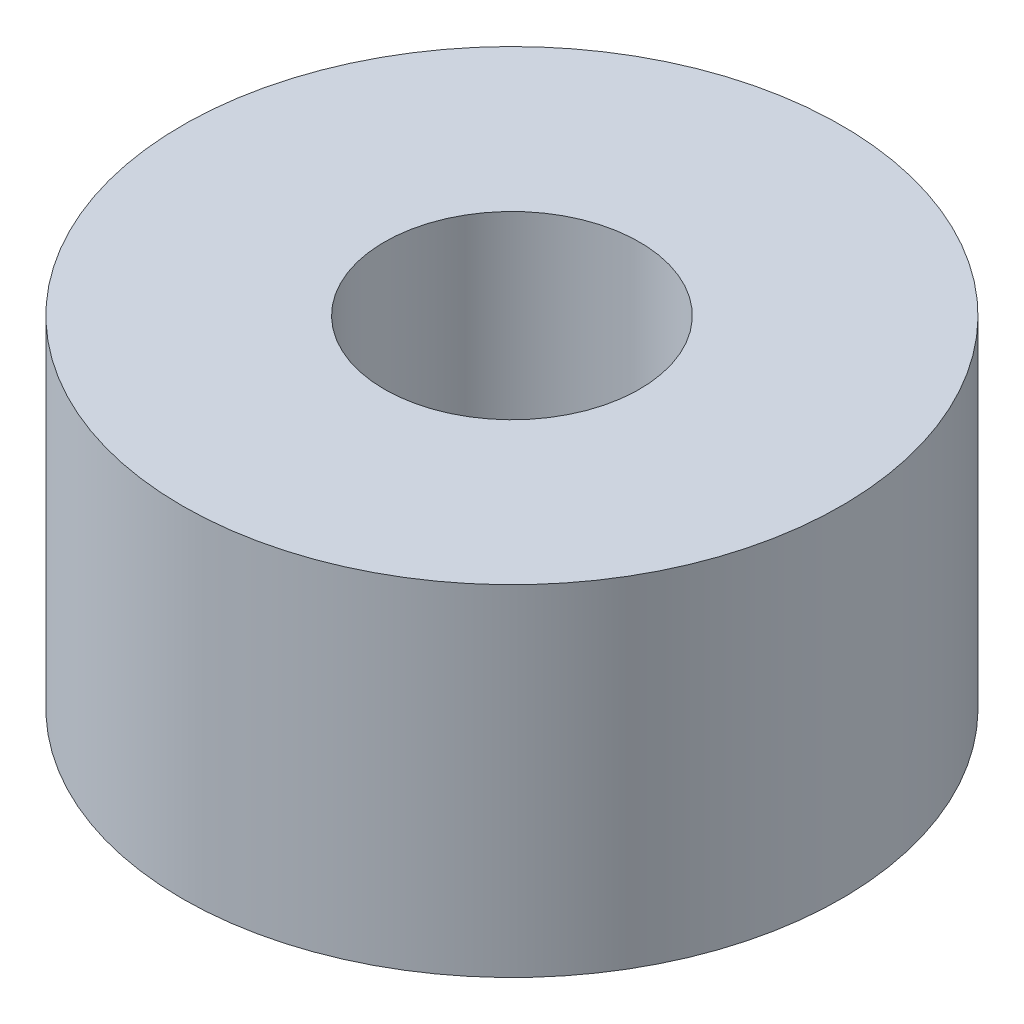
ISO-10303-21;
HEADER;
FILE_DESCRIPTION(('STEP AP214'),'2;1');
FILE_NAME('part.step','',(''),(''),'','','');
FILE_SCHEMA(('AUTOMOTIVE_DESIGN { 1 0 10303 214 1 1 1 1 }'));
ENDSEC;
DATA;
#1=APPLICATION_CONTEXT('core data for automotive mechanical design processes');
#2=APPLICATION_PROTOCOL_DEFINITION('international standard','automotive_design',2000,#1);
#3=PRODUCT_CONTEXT('',#1,'mechanical');
#4=PRODUCT('Part','Part','',(#3));
#5=PRODUCT_RELATED_PRODUCT_CATEGORY('part','',(#4));
#6=PRODUCT_DEFINITION_FORMATION('','',#4);
#7=PRODUCT_DEFINITION_CONTEXT('part definition',#1,'design');
#8=PRODUCT_DEFINITION('design','',#6,#7);
#9=PRODUCT_DEFINITION_SHAPE('','',#8);
#10=(LENGTH_UNIT() NAMED_UNIT(*) SI_UNIT(.MILLI.,.METRE.));
#11=(NAMED_UNIT(*) PLANE_ANGLE_UNIT() SI_UNIT($,.RADIAN.));
#12=(NAMED_UNIT(*) SI_UNIT($,.STERADIAN.) SOLID_ANGLE_UNIT());
#13=UNCERTAINTY_MEASURE_WITH_UNIT(LENGTH_MEASURE(1.E-05),#10,'distance_accuracy_value','');
#14=(GEOMETRIC_REPRESENTATION_CONTEXT(3) GLOBAL_UNCERTAINTY_ASSIGNED_CONTEXT((#13)) GLOBAL_UNIT_ASSIGNED_CONTEXT((#10,
#11,#12)) REPRESENTATION_CONTEXT('',''));
#15=CARTESIAN_POINT('',(0.,0.,0.));
#16=DIRECTION('',(0.,0.,1.));
#17=DIRECTION('',(1.,0.,0.));
#18=AXIS2_PLACEMENT_3D('',#15,#16,#17);
#19=CARTESIAN_POINT('',(0.,4.064,0.));
#20=DIRECTION('',(0.,1.,0.));
#21=DIRECTION('',(0.,0.,1.));
#22=AXIS2_PLACEMENT_3D('',#19,#20,#21);
#23=PLANE('',#22);
#24=CARTESIAN_POINT('',(0.,4.064,0.));
#25=DIRECTION('',(0.,1.,0.));
#26=DIRECTION('',(0.,0.,1.));
#27=AXIS2_PLACEMENT_3D('',#24,#25,#26);
#28=CIRCLE('',#27,3.937);
#29=CARTESIAN_POINT('',(0.,4.064,3.937));
#30=VERTEX_POINT('',#29);
#31=EDGE_CURVE('E10',#30,#30,#28,.T.);
#32=ORIENTED_EDGE('',*,*,#31,.T.);
#33=EDGE_LOOP('',(#32));
#34=FACE_BOUND('',#33,.T.);
#35=CARTESIAN_POINT('',(0.,4.064,0.));
#36=DIRECTION('',(0.,1.,0.));
#37=DIRECTION('',(0.,0.,1.));
#38=AXIS2_PLACEMENT_3D('',#35,#36,#37);
#39=CIRCLE('',#38,1.524);
#40=CARTESIAN_POINT('',(0.,4.064,1.524));
#41=VERTEX_POINT('',#40);
#42=EDGE_CURVE('E50',#41,#41,#39,.T.);
#43=ORIENTED_EDGE('',*,*,#42,.F.);
#44=EDGE_LOOP('',(#43));
#45=FACE_BOUND('',#44,.T.);
#46=ADVANCED_FACE('F37',(#34,#45),#23,.T.);
#47=CARTESIAN_POINT('',(0.,0.,0.));
#48=DIRECTION('',(0.,1.,0.));
#49=DIRECTION('',(0.,0.,1.));
#50=AXIS2_PLACEMENT_3D('',#47,#48,#49);
#51=PLANE('',#50);
#52=CARTESIAN_POINT('',(0.,0.,0.));
#53=DIRECTION('',(0.,1.,0.));
#54=DIRECTION('',(0.,0.,1.));
#55=AXIS2_PLACEMENT_3D('',#52,#53,#54);
#56=CIRCLE('',#55,3.937);
#57=CARTESIAN_POINT('',(0.,0.,3.937));
#58=VERTEX_POINT('',#57);
#59=EDGE_CURVE('E41',#58,#58,#56,.T.);
#60=ORIENTED_EDGE('',*,*,#59,.F.);
#61=EDGE_LOOP('',(#60));
#62=FACE_BOUND('',#61,.T.);
#63=CARTESIAN_POINT('',(0.,0.,0.));
#64=DIRECTION('',(0.,1.,0.));
#65=DIRECTION('',(0.,0.,1.));
#66=AXIS2_PLACEMENT_3D('',#63,#64,#65);
#67=CIRCLE('',#66,1.524);
#68=CARTESIAN_POINT('',(0.,0.,1.524));
#69=VERTEX_POINT('',#68);
#70=EDGE_CURVE('E52',#69,#69,#67,.T.);
#71=ORIENTED_EDGE('',*,*,#70,.T.);
#72=EDGE_LOOP('',(#71));
#73=FACE_BOUND('',#72,.T.);
#74=ADVANCED_FACE('F64',(#62,#73),#51,.F.);
#75=CARTESIAN_POINT('',(0.,4.064,0.));
#76=DIRECTION('',(0.,-1.,0.));
#77=DIRECTION('',(0.,0.,-1.));
#78=AXIS2_PLACEMENT_3D('',#75,#76,#77);
#79=CYLINDRICAL_SURFACE('',#78,3.937);
#80=ORIENTED_EDGE('',*,*,#31,.F.);
#81=EDGE_LOOP('',(#80));
#82=FACE_BOUND('',#81,.T.);
#83=ORIENTED_EDGE('',*,*,#59,.T.);
#84=EDGE_LOOP('',(#83));
#85=FACE_BOUND('',#84,.T.);
#86=ADVANCED_FACE('F39',(#82,#85),#79,.T.);
#87=CARTESIAN_POINT('',(0.,4.064,0.));
#88=DIRECTION('',(0.,-1.,0.));
#89=DIRECTION('',(0.,0.,-1.));
#90=AXIS2_PLACEMENT_3D('',#87,#88,#89);
#91=CYLINDRICAL_SURFACE('',#90,1.524);
#92=ORIENTED_EDGE('',*,*,#42,.T.);
#93=EDGE_LOOP('',(#92));
#94=FACE_BOUND('',#93,.T.);
#95=ORIENTED_EDGE('',*,*,#70,.F.);
#96=EDGE_LOOP('',(#95));
#97=FACE_BOUND('',#96,.T.);
#98=ADVANCED_FACE('F60',(#94,#97),#91,.F.);
#99=CLOSED_SHELL('',(#46,#74,#86,#98));
#100=MANIFOLD_SOLID_BREP('B2',#99);
#101=ADVANCED_BREP_SHAPE_REPRESENTATION('',(#18,#100),#14);
#102=SHAPE_DEFINITION_REPRESENTATION(#9,#101);
ENDSEC;
END-ISO-10303-21;
